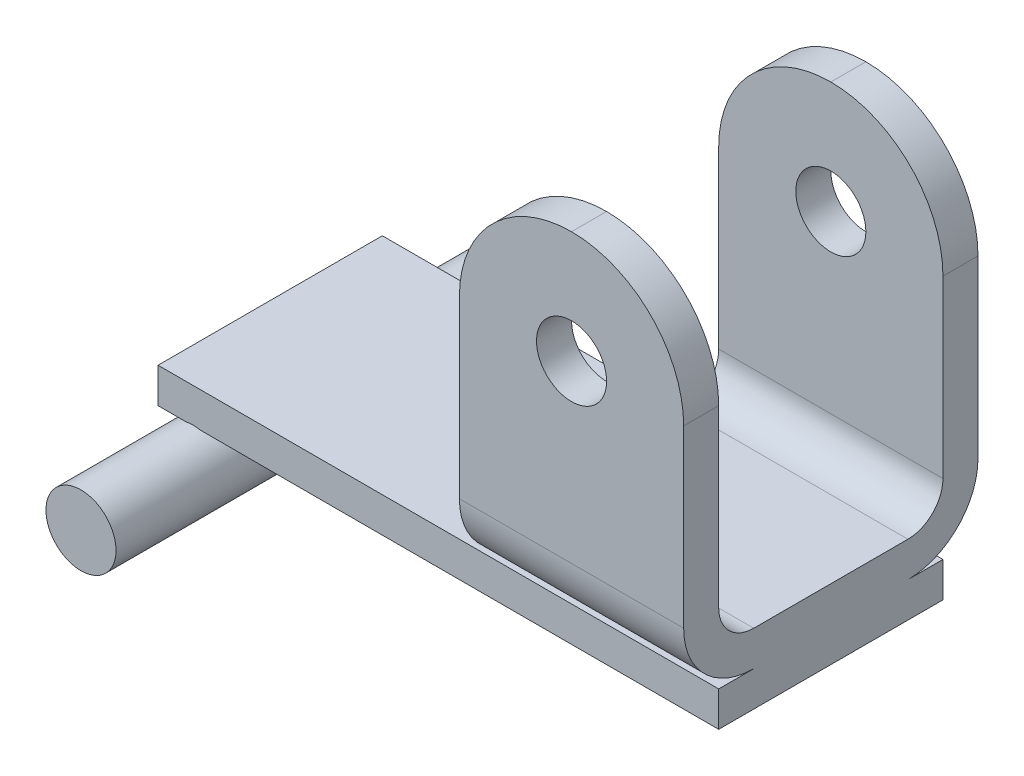
ISO-10303-21;
HEADER;
FILE_DESCRIPTION(('STEP AP214'),'2;1');
FILE_NAME('part.step','',(''),(''),'','','');
FILE_SCHEMA(('AUTOMOTIVE_DESIGN { 1 0 10303 214 1 1 1 1 }'));
ENDSEC;
DATA;
#1=APPLICATION_CONTEXT('core data for automotive mechanical design processes');
#2=APPLICATION_PROTOCOL_DEFINITION('international standard','automotive_design',2000,#1);
#3=PRODUCT_CONTEXT('',#1,'mechanical');
#4=PRODUCT('Part','Part','',(#3));
#5=PRODUCT_RELATED_PRODUCT_CATEGORY('part','',(#4));
#6=PRODUCT_DEFINITION_FORMATION('','',#4);
#7=PRODUCT_DEFINITION_CONTEXT('part definition',#1,'design');
#8=PRODUCT_DEFINITION('design','',#6,#7);
#9=PRODUCT_DEFINITION_SHAPE('','',#8);
#10=(LENGTH_UNIT() NAMED_UNIT(*) SI_UNIT(.MILLI.,.METRE.));
#11=(NAMED_UNIT(*) PLANE_ANGLE_UNIT() SI_UNIT($,.RADIAN.));
#12=(NAMED_UNIT(*) SI_UNIT($,.STERADIAN.) SOLID_ANGLE_UNIT());
#13=UNCERTAINTY_MEASURE_WITH_UNIT(LENGTH_MEASURE(1.E-05),#10,'distance_accuracy_value','');
#14=(GEOMETRIC_REPRESENTATION_CONTEXT(3) GLOBAL_UNCERTAINTY_ASSIGNED_CONTEXT((#13)) GLOBAL_UNIT_ASSIGNED_CONTEXT((#10,
#11,#12)) REPRESENTATION_CONTEXT('',''));
#15=CARTESIAN_POINT('',(0.,0.,0.));
#16=DIRECTION('',(0.,0.,1.));
#17=DIRECTION('',(1.,0.,0.));
#18=AXIS2_PLACEMENT_3D('',#15,#16,#17);
#19=CARTESIAN_POINT('',(-0.500000000000035,0.99,1.6));
#20=DIRECTION('',(0.,-1.,0.));
#21=DIRECTION('',(0.,0.,-1.));
#22=AXIS2_PLACEMENT_3D('',#19,#20,#21);
#23=PLANE('',#22);
#24=DIRECTION('',(1.,0.,0.));
#25=VECTOR('',#24,1.);
#26=CARTESIAN_POINT('',(4.29999999999997,0.990000000000008,1.09999999999999));
#27=LINE('',#26,#25);
#28=CARTESIAN_POINT('',(4.29999999999997,0.990000000000008,1.09999999999999));
#29=VERTEX_POINT('',#28);
#30=CARTESIAN_POINT('',(7.49999999999998,0.99000000000001,1.09999999999999));
#31=VERTEX_POINT('',#30);
#32=EDGE_CURVE('E173',#29,#31,#27,.T.);
#33=ORIENTED_EDGE('',*,*,#32,.F.);
#34=DIRECTION('',(0.,0.,1.));
#35=VECTOR('',#34,1.);
#36=CARTESIAN_POINT('',(4.29999999999997,0.990000000000008,1.09999999999999));
#37=LINE('',#36,#35);
#38=CARTESIAN_POINT('',(4.29999999999998,0.990000000000006,-1.09999999999999));
#39=VERTEX_POINT('',#38);
#40=EDGE_CURVE('E216',#39,#29,#37,.T.);
#41=ORIENTED_EDGE('',*,*,#40,.F.);
#42=DIRECTION('',(1.,0.,0.));
#43=VECTOR('',#42,1.);
#44=CARTESIAN_POINT('',(4.29999999999998,0.990000000000006,-1.09999999999999));
#45=LINE('',#44,#43);
#46=CARTESIAN_POINT('',(7.49999999999998,0.990000000000012,-1.09999999999999));
#47=VERTEX_POINT('',#46);
#48=EDGE_CURVE('E245',#39,#47,#45,.T.);
#49=ORIENTED_EDGE('',*,*,#48,.T.);
#50=DIRECTION('',(0.,0.,-1.));
#51=VECTOR('',#50,1.);
#52=CARTESIAN_POINT('',(7.49999999999997,0.990000000000013,1.6));
#53=LINE('',#52,#51);
#54=CARTESIAN_POINT('',(7.49999999999998,0.990000000000012,-1.6));
#55=VERTEX_POINT('',#54);
#56=EDGE_CURVE('E252',#47,#55,#53,.T.);
#57=ORIENTED_EDGE('',*,*,#56,.T.);
#58=DIRECTION('',(-1.,0.,0.));
#59=VECTOR('',#58,1.);
#60=CARTESIAN_POINT('',(-0.500000000000063,0.990000000000002,-1.6));
#61=LINE('',#60,#59);
#62=CARTESIAN_POINT('',(-0.500000000000063,0.990000000000002,-1.6));
#63=VERTEX_POINT('',#62);
#64=EDGE_CURVE('E400',#55,#63,#61,.T.);
#65=ORIENTED_EDGE('',*,*,#64,.T.);
#66=DIRECTION('',(0.,0.,-1.));
#67=VECTOR('',#66,1.);
#68=CARTESIAN_POINT('',(-0.500000000000035,0.99,1.6));
#69=LINE('',#68,#67);
#70=CARTESIAN_POINT('',(-0.500000000000035,0.99,1.6));
#71=VERTEX_POINT('',#70);
#72=EDGE_CURVE('E344',#71,#63,#69,.T.);
#73=ORIENTED_EDGE('',*,*,#72,.F.);
#74=DIRECTION('',(-1.,0.,0.));
#75=VECTOR('',#74,1.);
#76=CARTESIAN_POINT('',(-0.500000000000035,0.99,1.6));
#77=LINE('',#76,#75);
#78=CARTESIAN_POINT('',(7.49999999999997,0.990000000000013,1.6));
#79=VERTEX_POINT('',#78);
#80=EDGE_CURVE('E338',#79,#71,#77,.T.);
#81=ORIENTED_EDGE('',*,*,#80,.F.);
#82=EDGE_CURVE('E336',#79,#31,#53,.T.);
#83=ORIENTED_EDGE('',*,*,#82,.T.);
#84=EDGE_LOOP('',(#33,#41,#49,#57,#65,#73,#81,#83));
#85=FACE_BOUND('',#84,.T.);
#86=ADVANCED_FACE('F32',(#85),#23,.F.);
#87=CARTESIAN_POINT('',(0.,0.,3.2));
#88=DIRECTION('',(0.,0.,-1.));
#89=DIRECTION('',(-1.,0.,0.));
#90=AXIS2_PLACEMENT_3D('',#87,#88,#89);
#91=CYLINDRICAL_SURFACE('',#90,0.5);
#92=DIRECTION('',(0.,0.,-1.));
#93=VECTOR('',#92,1.);
#94=CARTESIAN_POINT('',(0.0994987437106659,0.49,3.19999999999998));
#95=LINE('',#94,#93);
#96=CARTESIAN_POINT('',(0.0994987437106659,0.490000000000004,1.59999999999998));
#97=VERTEX_POINT('',#96);
#98=CARTESIAN_POINT('',(0.0994987437106659,0.49,-1.60000000000002));
#99=VERTEX_POINT('',#98);
#100=EDGE_CURVE('E365',#97,#99,#95,.T.);
#101=ORIENTED_EDGE('',*,*,#100,.F.);
#102=CARTESIAN_POINT('',(0.,0.,1.6));
#103=DIRECTION('',(0.,0.,1.));
#104=DIRECTION('',(1.,0.,0.));
#105=AXIS2_PLACEMENT_3D('',#102,#103,#104);
#106=CIRCLE('',#105,0.5);
#107=CARTESIAN_POINT('',(-0.0994987437106659,0.49,1.6));
#108=VERTEX_POINT('',#107);
#109=EDGE_CURVE('E266',#97,#108,#106,.T.);
#110=ORIENTED_EDGE('',*,*,#109,.T.);
#111=DIRECTION('',(0.,0.,-1.));
#112=VECTOR('',#111,1.);
#113=CARTESIAN_POINT('',(-0.0994987437106937,0.490000000000003,3.2));
#114=LINE('',#113,#112);
#115=CARTESIAN_POINT('',(-0.0994987437107006,0.490000000000001,-1.6));
#116=VERTEX_POINT('',#115);
#117=EDGE_CURVE('E363',#116,#108,#114,.F.);
#118=ORIENTED_EDGE('',*,*,#117,.F.);
#119=CARTESIAN_POINT('',(0.,0.,-1.6));
#120=DIRECTION('',(0.,0.,1.));
#121=DIRECTION('',(1.,0.,0.));
#122=AXIS2_PLACEMENT_3D('',#119,#120,#121);
#123=CIRCLE('',#122,0.5);
#124=EDGE_CURVE('E360',#99,#116,#123,.T.);
#125=ORIENTED_EDGE('',*,*,#124,.F.);
#126=EDGE_LOOP('',(#101,#110,#118,#125));
#127=FACE_BOUND('',#126,.T.);
#128=CARTESIAN_POINT('',(0.,0.,3.2));
#129=DIRECTION('',(0.,0.,1.));
#130=DIRECTION('',(1.,0.,0.));
#131=AXIS2_PLACEMENT_3D('',#128,#129,#130);
#132=CIRCLE('',#131,0.5);
#133=CARTESIAN_POINT('',(0.5,0.,3.2));
#134=VERTEX_POINT('',#133);
#135=EDGE_CURVE('E357',#134,#134,#132,.T.);
#136=ORIENTED_EDGE('',*,*,#135,.F.);
#137=EDGE_LOOP('',(#136));
#138=FACE_BOUND('',#137,.T.);
#139=CARTESIAN_POINT('',(0.,0.,-3.2));
#140=DIRECTION('',(0.,0.,1.));
#141=DIRECTION('',(1.,0.,0.));
#142=AXIS2_PLACEMENT_3D('',#139,#140,#141);
#143=CIRCLE('',#142,0.5);
#144=CARTESIAN_POINT('',(0.499999999999966,0.,-3.2));
#145=VERTEX_POINT('',#144);
#146=EDGE_CURVE('E354',#145,#145,#143,.T.);
#147=ORIENTED_EDGE('',*,*,#146,.T.);
#148=EDGE_LOOP('',(#147));
#149=FACE_BOUND('',#148,.T.);
#150=ADVANCED_FACE('F34',(#127,#138,#149),#91,.T.);
#151=CARTESIAN_POINT('',(0.,0.,3.2));
#152=DIRECTION('',(0.,0.,1.));
#153=DIRECTION('',(1.,0.,0.));
#154=AXIS2_PLACEMENT_3D('',#151,#152,#153);
#155=PLANE('',#154);
#156=ORIENTED_EDGE('',*,*,#135,.T.);
#157=EDGE_LOOP('',(#156));
#158=FACE_BOUND('',#157,.T.);
#159=ADVANCED_FACE('F415',(#158),#155,.T.);
#160=CARTESIAN_POINT('',(0.,0.,-3.2));
#161=DIRECTION('',(0.,0.,1.));
#162=DIRECTION('',(1.,0.,0.));
#163=AXIS2_PLACEMENT_3D('',#160,#161,#162);
#164=PLANE('',#163);
#165=ORIENTED_EDGE('',*,*,#146,.F.);
#166=EDGE_LOOP('',(#165));
#167=FACE_BOUND('',#166,.T.);
#168=ADVANCED_FACE('F409',(#167),#164,.F.);
#169=CARTESIAN_POINT('',(-0.5,0.489999999999996,1.6));
#170=DIRECTION('',(0.,1.,0.));
#171=DIRECTION('',(0.,0.,1.));
#172=AXIS2_PLACEMENT_3D('',#169,#170,#171);
#173=PLANE('',#172);
#174=DIRECTION('',(1.,0.,0.));
#175=VECTOR('',#174,1.);
#176=CARTESIAN_POINT('',(-0.5,0.489999999999996,1.6));
#177=LINE('',#176,#175);
#178=CARTESIAN_POINT('',(7.49999999999998,0.490000000000009,1.6));
#179=VERTEX_POINT('',#178);
#180=EDGE_CURVE('E386',#97,#179,#177,.T.);
#181=ORIENTED_EDGE('',*,*,#180,.F.);
#182=ORIENTED_EDGE('',*,*,#100,.T.);
#183=DIRECTION('',(1.,0.,0.));
#184=VECTOR('',#183,1.);
#185=CARTESIAN_POINT('',(-0.500000000000035,0.489999999999999,-1.6));
#186=LINE('',#185,#184);
#187=CARTESIAN_POINT('',(7.49999999999999,0.490000000000011,-1.6));
#188=VERTEX_POINT('',#187);
#189=EDGE_CURVE('E401',#99,#188,#186,.T.);
#190=ORIENTED_EDGE('',*,*,#189,.T.);
#191=DIRECTION('',(0.,0.,-1.));
#192=VECTOR('',#191,1.);
#193=CARTESIAN_POINT('',(7.49999999999998,0.490000000000009,1.6));
#194=LINE('',#193,#192);
#195=EDGE_CURVE('E340',#179,#188,#194,.T.);
#196=ORIENTED_EDGE('',*,*,#195,.F.);
#197=EDGE_LOOP('',(#181,#182,#190,#196));
#198=FACE_BOUND('',#197,.T.);
#199=ADVANCED_FACE('F407',(#198),#173,.F.);
#200=CARTESIAN_POINT('',(-0.500000000000035,0.489999999999999,-1.6));
#201=VERTEX_POINT('',#200);
#202=EDGE_CURVE('E380',#201,#116,#186,.T.);
#203=ORIENTED_EDGE('',*,*,#202,.T.);
#204=ORIENTED_EDGE('',*,*,#117,.T.);
#205=CARTESIAN_POINT('',(-0.5,0.489999999999996,1.6));
#206=VERTEX_POINT('',#205);
#207=EDGE_CURVE('E378',#206,#108,#177,.T.);
#208=ORIENTED_EDGE('',*,*,#207,.F.);
#209=DIRECTION('',(0.,0.,-1.));
#210=VECTOR('',#209,1.);
#211=CARTESIAN_POINT('',(-0.5,0.489999999999996,1.6));
#212=LINE('',#211,#210);
#213=EDGE_CURVE('E342',#206,#201,#212,.T.);
#214=ORIENTED_EDGE('',*,*,#213,.T.);
#215=EDGE_LOOP('',(#203,#204,#208,#214));
#216=FACE_BOUND('',#215,.T.);
#217=ADVANCED_FACE('F377',(#216),#173,.F.);
#218=CARTESIAN_POINT('',(-0.5,0.489999999999996,1.6));
#219=DIRECTION('',(0.,0.,1.));
#220=DIRECTION('',(1.,0.,0.));
#221=AXIS2_PLACEMENT_3D('',#218,#219,#220);
#222=PLANE('',#221);
#223=ORIENTED_EDGE('',*,*,#109,.F.);
#224=ORIENTED_EDGE('',*,*,#180,.T.);
#225=DIRECTION('',(0.,1.,0.));
#226=VECTOR('',#225,1.);
#227=CARTESIAN_POINT('',(7.49999999999997,0.990000000000013,1.6));
#228=LINE('',#227,#226);
#229=EDGE_CURVE('E385',#179,#79,#228,.T.);
#230=ORIENTED_EDGE('',*,*,#229,.T.);
#231=ORIENTED_EDGE('',*,*,#80,.T.);
#232=DIRECTION('',(0.,-1.,0.));
#233=VECTOR('',#232,1.);
#234=CARTESIAN_POINT('',(-0.500000000000035,0.99,1.6));
#235=LINE('',#234,#233);
#236=EDGE_CURVE('E383',#71,#206,#235,.T.);
#237=ORIENTED_EDGE('',*,*,#236,.T.);
#238=ORIENTED_EDGE('',*,*,#207,.T.);
#239=EDGE_LOOP('',(#223,#224,#230,#231,#237,#238));
#240=FACE_BOUND('',#239,.T.);
#241=ADVANCED_FACE('F381',(#240),#222,.T.);
#242=CARTESIAN_POINT('',(-0.500000000000035,0.489999999999999,-1.6));
#243=DIRECTION('',(0.,0.,1.));
#244=DIRECTION('',(1.,0.,0.));
#245=AXIS2_PLACEMENT_3D('',#242,#243,#244);
#246=PLANE('',#245);
#247=ORIENTED_EDGE('',*,*,#189,.F.);
#248=ORIENTED_EDGE('',*,*,#124,.T.);
#249=ORIENTED_EDGE('',*,*,#202,.F.);
#250=DIRECTION('',(0.,-1.,0.));
#251=VECTOR('',#250,1.);
#252=CARTESIAN_POINT('',(-0.500000000000063,0.990000000000002,-1.6));
#253=LINE('',#252,#251);
#254=EDGE_CURVE('E234',#63,#201,#253,.T.);
#255=ORIENTED_EDGE('',*,*,#254,.F.);
#256=ORIENTED_EDGE('',*,*,#64,.F.);
#257=DIRECTION('',(0.,1.,0.));
#258=VECTOR('',#257,1.);
#259=CARTESIAN_POINT('',(7.49999999999998,0.990000000000012,-1.6));
#260=LINE('',#259,#258);
#261=EDGE_CURVE('E404',#188,#55,#260,.T.);
#262=ORIENTED_EDGE('',*,*,#261,.F.);
#263=EDGE_LOOP('',(#247,#248,#249,#255,#256,#262));
#264=FACE_BOUND('',#263,.T.);
#265=ADVANCED_FACE('F398',(#264),#246,.F.);
#266=CARTESIAN_POINT('',(-0.500000000000035,0.99,1.6));
#267=DIRECTION('',(1.,0.,0.));
#268=DIRECTION('',(0.,1.,0.));
#269=AXIS2_PLACEMENT_3D('',#266,#267,#268);
#270=PLANE('',#269);
#271=ORIENTED_EDGE('',*,*,#254,.T.);
#272=ORIENTED_EDGE('',*,*,#213,.F.);
#273=ORIENTED_EDGE('',*,*,#236,.F.);
#274=ORIENTED_EDGE('',*,*,#72,.T.);
#275=EDGE_LOOP('',(#271,#272,#273,#274));
#276=FACE_BOUND('',#275,.T.);
#277=ADVANCED_FACE('F395',(#276),#270,.F.);
#278=CARTESIAN_POINT('',(7.49999999999997,0.990000000000013,1.6));
#279=DIRECTION('',(-1.,0.,0.));
#280=DIRECTION('',(0.,0.,1.));
#281=AXIS2_PLACEMENT_3D('',#278,#279,#280);
#282=PLANE('',#281);
#283=DIRECTION('',(0.,-1.,0.));
#284=VECTOR('',#283,1.);
#285=CARTESIAN_POINT('',(7.5,6.09000000000002,-2.10000000000002));
#286=LINE('',#285,#284);
#287=CARTESIAN_POINT('',(7.49999999999999,4.49000000000002,-2.10000000000002));
#288=VERTEX_POINT('',#287);
#289=CARTESIAN_POINT('',(7.49999999999998,1.99000000000002,-2.1));
#290=VERTEX_POINT('',#289);
#291=EDGE_CURVE('E197',#288,#290,#286,.T.);
#292=ORIENTED_EDGE('',*,*,#291,.F.);
#293=DIRECTION('',(0.,0.,-1.));
#294=VECTOR('',#293,1.);
#295=CARTESIAN_POINT('',(7.49999999999997,4.49000000000002,1.59999999999998));
#296=LINE('',#295,#294);
#297=CARTESIAN_POINT('',(7.49999999999999,4.49000000000002,-1.60000000000002));
#298=VERTEX_POINT('',#297);
#299=EDGE_CURVE('E269',#288,#298,#296,.F.);
#300=ORIENTED_EDGE('',*,*,#299,.T.);
#301=DIRECTION('',(0.,1.,0.));
#302=VECTOR('',#301,1.);
#303=CARTESIAN_POINT('',(7.5,6.09000000000002,-1.60000000000001));
#304=LINE('',#303,#302);
#305=CARTESIAN_POINT('',(7.49999999999998,1.99000000000002,-1.6));
#306=VERTEX_POINT('',#305);
#307=EDGE_CURVE('E199',#298,#306,#304,.F.);
#308=ORIENTED_EDGE('',*,*,#307,.T.);
#309=CARTESIAN_POINT('',(7.49999999999997,1.99000000000001,-1.1));
#310=DIRECTION('',(1.,0.,0.));
#311=DIRECTION('',(0.,0.,-1.));
#312=AXIS2_PLACEMENT_3D('',#309,#310,#311);
#313=CIRCLE('',#312,0.5);
#314=CARTESIAN_POINT('',(7.49999999999999,1.49000000000001,-1.09999999999999));
#315=VERTEX_POINT('',#314);
#316=EDGE_CURVE('E201',#306,#315,#313,.F.);
#317=ORIENTED_EDGE('',*,*,#316,.T.);
#318=DIRECTION('',(0.,0.,-1.));
#319=VECTOR('',#318,1.);
#320=CARTESIAN_POINT('',(7.49999999999998,1.49000000000001,1.09999999999999));
#321=LINE('',#320,#319);
#322=CARTESIAN_POINT('',(7.49999999999998,1.49000000000001,1.1));
#323=VERTEX_POINT('',#322);
#324=EDGE_CURVE('E204',#315,#323,#321,.F.);
#325=ORIENTED_EDGE('',*,*,#324,.T.);
#326=CARTESIAN_POINT('',(7.49999999999997,1.99000000000001,1.1));
#327=DIRECTION('',(1.,0.,0.));
#328=DIRECTION('',(0.,0.,-1.));
#329=AXIS2_PLACEMENT_3D('',#326,#327,#328);
#330=CIRCLE('',#329,0.5);
#331=CARTESIAN_POINT('',(7.49999999999998,1.99000000000002,1.6));
#332=VERTEX_POINT('',#331);
#333=EDGE_CURVE('E207',#323,#332,#330,.F.);
#334=ORIENTED_EDGE('',*,*,#333,.T.);
#335=DIRECTION('',(0.,1.,0.));
#336=VECTOR('',#335,1.);
#337=CARTESIAN_POINT('',(7.49999999999999,6.09000000000002,1.59999999999999));
#338=LINE('',#337,#336);
#339=CARTESIAN_POINT('',(7.49999999999997,4.49000000000002,1.59999999999998));
#340=VERTEX_POINT('',#339);
#341=EDGE_CURVE('E191',#332,#340,#338,.T.);
#342=ORIENTED_EDGE('',*,*,#341,.T.);
#343=DIRECTION('',(0.,0.,-1.));
#344=VECTOR('',#343,1.);
#345=CARTESIAN_POINT('',(7.49999999999997,4.49000000000002,1.59999999999998));
#346=LINE('',#345,#344);
#347=CARTESIAN_POINT('',(7.5,4.49000000000002,2.09999999999998));
#348=VERTEX_POINT('',#347);
#349=EDGE_CURVE('E190',#340,#348,#346,.F.);
#350=ORIENTED_EDGE('',*,*,#349,.T.);
#351=DIRECTION('',(0.,1.,0.));
#352=VECTOR('',#351,1.);
#353=CARTESIAN_POINT('',(7.5,6.09000000000002,2.09999999999998));
#354=LINE('',#353,#352);
#355=CARTESIAN_POINT('',(7.5,1.99000000000002,2.1));
#356=VERTEX_POINT('',#355);
#357=EDGE_CURVE('E179',#356,#348,#354,.T.);
#358=ORIENTED_EDGE('',*,*,#357,.F.);
#359=CARTESIAN_POINT('',(7.49999999999997,1.99000000000001,1.1));
#360=DIRECTION('',(-1.,0.,0.));
#361=DIRECTION('',(0.,0.,1.));
#362=AXIS2_PLACEMENT_3D('',#359,#360,#361);
#363=CIRCLE('',#362,1.);
#364=EDGE_CURVE('E167',#31,#356,#363,.T.);
#365=ORIENTED_EDGE('',*,*,#364,.F.);
#366=ORIENTED_EDGE('',*,*,#82,.F.);
#367=ORIENTED_EDGE('',*,*,#229,.F.);
#368=ORIENTED_EDGE('',*,*,#195,.T.);
#369=ORIENTED_EDGE('',*,*,#261,.T.);
#370=ORIENTED_EDGE('',*,*,#56,.F.);
#371=CARTESIAN_POINT('',(7.49999999999997,1.99000000000001,-1.1));
#372=DIRECTION('',(-1.,0.,0.));
#373=DIRECTION('',(0.,0.,1.));
#374=AXIS2_PLACEMENT_3D('',#371,#372,#373);
#375=CIRCLE('',#374,1.);
#376=EDGE_CURVE('E178',#290,#47,#375,.T.);
#377=ORIENTED_EDGE('',*,*,#376,.F.);
#378=EDGE_LOOP('',(#292,#300,#308,#317,#325,#334,#342,#350,#358,#365,#366,#367,#368,#369,#370,#377));
#379=FACE_BOUND('',#378,.T.);
#380=ADVANCED_FACE('F187',(#379),#282,.F.);
#381=CARTESIAN_POINT('',(4.29999999999998,6.09000000000001,1.6));
#382=DIRECTION('',(0.,0.,-1.));
#383=DIRECTION('',(0.,1.,0.));
#384=AXIS2_PLACEMENT_3D('',#381,#382,#383);
#385=PLANE('',#384);
#386=CARTESIAN_POINT('',(5.89999999999998,4.49000000000002,1.6));
#387=DIRECTION('',(0.,0.,-1.));
#388=DIRECTION('',(0.,1.,0.));
#389=AXIS2_PLACEMENT_3D('',#386,#387,#388);
#390=CIRCLE('',#389,0.500000000000001);
#391=CARTESIAN_POINT('',(5.89999999999998,4.99000000000002,1.6));
#392=VERTEX_POINT('',#391);
#393=EDGE_CURVE('E193',#392,#392,#390,.T.);
#394=ORIENTED_EDGE('',*,*,#393,.F.);
#395=EDGE_LOOP('',(#394));
#396=FACE_BOUND('',#395,.T.);
#397=CARTESIAN_POINT('',(5.89999999999997,4.49000000000002,1.6));
#398=DIRECTION('',(0.,0.,-1.));
#399=DIRECTION('',(0.,1.,0.));
#400=AXIS2_PLACEMENT_3D('',#397,#398,#399);
#401=CIRCLE('',#400,1.6);
#402=CARTESIAN_POINT('',(4.29999999999998,4.49000000000001,1.6));
#403=VERTEX_POINT('',#402);
#404=CARTESIAN_POINT('',(5.89999999999998,6.09000000000002,1.59999999999998));
#405=VERTEX_POINT('',#404);
#406=EDGE_CURVE('E276',#403,#405,#401,.T.);
#407=ORIENTED_EDGE('',*,*,#406,.T.);
#408=CARTESIAN_POINT('',(5.89999999999997,4.49000000000002,1.6));
#409=DIRECTION('',(0.,0.,-1.));
#410=DIRECTION('',(0.,1.,0.));
#411=AXIS2_PLACEMENT_3D('',#408,#409,#410);
#412=CIRCLE('',#411,1.6);
#413=EDGE_CURVE('E278',#405,#340,#412,.T.);
#414=ORIENTED_EDGE('',*,*,#413,.T.);
#415=ORIENTED_EDGE('',*,*,#341,.F.);
#416=DIRECTION('',(1.,0.,0.));
#417=VECTOR('',#416,1.);
#418=CARTESIAN_POINT('',(4.29999999999997,1.99000000000002,1.59999999999998));
#419=LINE('',#418,#417);
#420=CARTESIAN_POINT('',(4.29999999999997,1.99000000000002,1.59999999999998));
#421=VERTEX_POINT('',#420);
#422=EDGE_CURVE('E232',#421,#332,#419,.T.);
#423=ORIENTED_EDGE('',*,*,#422,.F.);
#424=DIRECTION('',(0.,1.,0.));
#425=VECTOR('',#424,1.);
#426=CARTESIAN_POINT('',(4.29999999999998,6.09000000000001,1.6));
#427=LINE('',#426,#425);
#428=EDGE_CURVE('E210',#421,#403,#427,.T.);
#429=ORIENTED_EDGE('',*,*,#428,.T.);
#430=EDGE_LOOP('',(#407,#414,#415,#423,#429));
#431=FACE_BOUND('',#430,.T.);
#432=ADVANCED_FACE('F290',(#396,#431),#385,.T.);
#433=CARTESIAN_POINT('',(4.29999999999998,1.99000000000001,1.09999999999998));
#434=DIRECTION('',(1.,0.,0.));
#435=DIRECTION('',(0.,0.,-1.));
#436=AXIS2_PLACEMENT_3D('',#433,#434,#435);
#437=CYLINDRICAL_SURFACE('',#436,0.5);
#438=ORIENTED_EDGE('',*,*,#333,.F.);
#439=DIRECTION('',(1.,0.,0.));
#440=VECTOR('',#439,1.);
#441=CARTESIAN_POINT('',(4.29999999999997,1.49000000000001,1.1));
#442=LINE('',#441,#440);
#443=CARTESIAN_POINT('',(4.29999999999997,1.49000000000001,1.1));
#444=VERTEX_POINT('',#443);
#445=EDGE_CURVE('E235',#444,#323,#442,.T.);
#446=ORIENTED_EDGE('',*,*,#445,.F.);
#447=CARTESIAN_POINT('',(4.29999999999998,1.99000000000001,1.09999999999998));
#448=DIRECTION('',(1.,0.,0.));
#449=DIRECTION('',(0.,0.,-1.));
#450=AXIS2_PLACEMENT_3D('',#447,#448,#449);
#451=CIRCLE('',#450,0.5);
#452=EDGE_CURVE('E183',#444,#421,#451,.F.);
#453=ORIENTED_EDGE('',*,*,#452,.T.);
#454=ORIENTED_EDGE('',*,*,#422,.T.);
#455=EDGE_LOOP('',(#438,#446,#453,#454));
#456=FACE_BOUND('',#455,.T.);
#457=ADVANCED_FACE('F304',(#456),#437,.F.);
#458=CARTESIAN_POINT('',(4.29999999999997,1.49000000000001,1.09999999999999));
#459=DIRECTION('',(0.,1.,0.));
#460=DIRECTION('',(0.,0.,1.));
#461=AXIS2_PLACEMENT_3D('',#458,#459,#460);
#462=PLANE('',#461);
#463=ORIENTED_EDGE('',*,*,#324,.F.);
#464=DIRECTION('',(1.,0.,0.));
#465=VECTOR('',#464,1.);
#466=CARTESIAN_POINT('',(4.29999999999998,1.49000000000001,-1.09999999999999));
#467=LINE('',#466,#465);
#468=CARTESIAN_POINT('',(4.29999999999998,1.49000000000001,-1.09999999999999));
#469=VERTEX_POINT('',#468);
#470=EDGE_CURVE('E237',#469,#315,#467,.T.);
#471=ORIENTED_EDGE('',*,*,#470,.F.);
#472=DIRECTION('',(0.,0.,-1.));
#473=VECTOR('',#472,1.);
#474=CARTESIAN_POINT('',(4.29999999999997,1.49000000000001,1.09999999999999));
#475=LINE('',#474,#473);
#476=EDGE_CURVE('E227',#469,#444,#475,.F.);
#477=ORIENTED_EDGE('',*,*,#476,.T.);
#478=ORIENTED_EDGE('',*,*,#445,.T.);
#479=EDGE_LOOP('',(#463,#471,#477,#478));
#480=FACE_BOUND('',#479,.T.);
#481=ADVANCED_FACE('F498',(#480),#462,.T.);
#482=CARTESIAN_POINT('',(4.29999999999998,1.99000000000001,-1.10000000000002));
#483=DIRECTION('',(1.,0.,0.));
#484=DIRECTION('',(0.,0.,-1.));
#485=AXIS2_PLACEMENT_3D('',#482,#483,#484);
#486=CYLINDRICAL_SURFACE('',#485,0.5);
#487=ORIENTED_EDGE('',*,*,#316,.F.);
#488=DIRECTION('',(1.,0.,0.));
#489=VECTOR('',#488,1.);
#490=CARTESIAN_POINT('',(4.29999999999998,1.99000000000001,-1.60000000000002));
#491=LINE('',#490,#489);
#492=CARTESIAN_POINT('',(4.29999999999998,1.99000000000001,-1.60000000000002));
#493=VERTEX_POINT('',#492);
#494=EDGE_CURVE('E239',#493,#306,#491,.T.);
#495=ORIENTED_EDGE('',*,*,#494,.F.);
#496=CARTESIAN_POINT('',(4.29999999999998,1.99000000000001,-1.10000000000002));
#497=DIRECTION('',(1.,0.,0.));
#498=DIRECTION('',(0.,0.,-1.));
#499=AXIS2_PLACEMENT_3D('',#496,#497,#498);
#500=CIRCLE('',#499,0.5);
#501=EDGE_CURVE('E224',#493,#469,#500,.F.);
#502=ORIENTED_EDGE('',*,*,#501,.T.);
#503=ORIENTED_EDGE('',*,*,#470,.T.);
#504=EDGE_LOOP('',(#487,#495,#502,#503));
#505=FACE_BOUND('',#504,.T.);
#506=ADVANCED_FACE('F311',(#505),#486,.F.);
#507=CARTESIAN_POINT('',(4.29999999999999,6.09000000000001,-1.6));
#508=DIRECTION('',(0.,0.,1.));
#509=DIRECTION('',(1.,0.,0.));
#510=AXIS2_PLACEMENT_3D('',#507,#508,#509);
#511=PLANE('',#510);
#512=CARTESIAN_POINT('',(5.89999999999999,4.49000000000001,-1.6));
#513=DIRECTION('',(0.,0.,1.));
#514=DIRECTION('',(1.,0.,0.));
#515=AXIS2_PLACEMENT_3D('',#512,#513,#514);
#516=CIRCLE('',#515,0.500000000000001);
#517=CARTESIAN_POINT('',(6.39999999999999,4.49000000000002,-1.6));
#518=VERTEX_POINT('',#517);
#519=EDGE_CURVE('E631',#518,#518,#516,.T.);
#520=ORIENTED_EDGE('',*,*,#519,.F.);
#521=EDGE_LOOP('',(#520));
#522=FACE_BOUND('',#521,.T.);
#523=ORIENTED_EDGE('',*,*,#307,.F.);
#524=CARTESIAN_POINT('',(5.89999999999999,4.49000000000001,-1.6));
#525=DIRECTION('',(0.,0.,1.));
#526=DIRECTION('',(1.,0.,0.));
#527=AXIS2_PLACEMENT_3D('',#524,#525,#526);
#528=CIRCLE('',#527,1.6);
#529=CARTESIAN_POINT('',(5.89999999999999,6.09000000000001,-1.60000000000002));
#530=VERTEX_POINT('',#529);
#531=EDGE_CURVE('E274',#298,#530,#528,.T.);
#532=ORIENTED_EDGE('',*,*,#531,.T.);
#533=CARTESIAN_POINT('',(5.89999999999999,4.49000000000001,-1.6));
#534=DIRECTION('',(0.,0.,1.));
#535=DIRECTION('',(1.,0.,0.));
#536=AXIS2_PLACEMENT_3D('',#533,#534,#535);
#537=CIRCLE('',#536,1.6);
#538=CARTESIAN_POINT('',(4.29999999999999,4.49000000000001,-1.6));
#539=VERTEX_POINT('',#538);
#540=EDGE_CURVE('E272',#530,#539,#537,.T.);
#541=ORIENTED_EDGE('',*,*,#540,.T.);
#542=DIRECTION('',(0.,1.,0.));
#543=VECTOR('',#542,1.);
#544=CARTESIAN_POINT('',(4.29999999999999,6.09000000000001,-1.6));
#545=LINE('',#544,#543);
#546=EDGE_CURVE('E222',#539,#493,#545,.F.);
#547=ORIENTED_EDGE('',*,*,#546,.T.);
#548=ORIENTED_EDGE('',*,*,#494,.T.);
#549=EDGE_LOOP('',(#523,#532,#541,#547,#548));
#550=FACE_BOUND('',#549,.T.);
#551=ADVANCED_FACE('F314',(#522,#550),#511,.T.);
#552=CARTESIAN_POINT('',(4.3,6.09000000000002,-2.1));
#553=DIRECTION('',(0.,0.,1.));
#554=DIRECTION('',(1.,0.,0.));
#555=AXIS2_PLACEMENT_3D('',#552,#553,#554);
#556=PLANE('',#555);
#557=CARTESIAN_POINT('',(5.89999999999999,4.49000000000002,-2.1));
#558=DIRECTION('',(0.,0.,1.));
#559=DIRECTION('',(1.,0.,0.));
#560=AXIS2_PLACEMENT_3D('',#557,#558,#559);
#561=CIRCLE('',#560,0.500000000000001);
#562=CARTESIAN_POINT('',(6.39999999999999,4.49000000000002,-2.1));
#563=VERTEX_POINT('',#562);
#564=EDGE_CURVE('E626',#563,#563,#561,.T.);
#565=ORIENTED_EDGE('',*,*,#564,.T.);
#566=EDGE_LOOP('',(#565));
#567=FACE_BOUND('',#566,.T.);
#568=CARTESIAN_POINT('',(5.89999999999999,4.49000000000002,-2.1));
#569=DIRECTION('',(0.,0.,1.));
#570=DIRECTION('',(1.,0.,0.));
#571=AXIS2_PLACEMENT_3D('',#568,#569,#570);
#572=CIRCLE('',#571,1.6);
#573=CARTESIAN_POINT('',(4.29999999999999,4.49000000000002,-2.1));
#574=VERTEX_POINT('',#573);
#575=CARTESIAN_POINT('',(5.89999999999999,6.09000000000002,-2.10000000000002));
#576=VERTEX_POINT('',#575);
#577=EDGE_CURVE('E263',#574,#576,#572,.F.);
#578=ORIENTED_EDGE('',*,*,#577,.T.);
#579=CARTESIAN_POINT('',(5.89999999999999,4.49000000000002,-2.1));
#580=DIRECTION('',(0.,0.,1.));
#581=DIRECTION('',(1.,0.,0.));
#582=AXIS2_PLACEMENT_3D('',#579,#580,#581);
#583=CIRCLE('',#582,1.6);
#584=EDGE_CURVE('E265',#576,#288,#583,.F.);
#585=ORIENTED_EDGE('',*,*,#584,.T.);
#586=ORIENTED_EDGE('',*,*,#291,.T.);
#587=DIRECTION('',(1.,0.,0.));
#588=VECTOR('',#587,1.);
#589=CARTESIAN_POINT('',(4.29999999999999,1.99000000000002,-2.10000000000002));
#590=LINE('',#589,#588);
#591=CARTESIAN_POINT('',(4.29999999999999,1.99000000000002,-2.10000000000002));
#592=VERTEX_POINT('',#591);
#593=EDGE_CURVE('E242',#592,#290,#590,.T.);
#594=ORIENTED_EDGE('',*,*,#593,.F.);
#595=DIRECTION('',(0.,-1.,0.));
#596=VECTOR('',#595,1.);
#597=CARTESIAN_POINT('',(4.3,6.09000000000002,-2.1));
#598=LINE('',#597,#596);
#599=EDGE_CURVE('E220',#574,#592,#598,.T.);
#600=ORIENTED_EDGE('',*,*,#599,.F.);
#601=EDGE_LOOP('',(#578,#585,#586,#594,#600));
#602=FACE_BOUND('',#601,.T.);
#603=ADVANCED_FACE('F325',(#567,#602),#556,.F.);
#604=CARTESIAN_POINT('',(4.29999999999998,1.99000000000001,-1.10000000000002));
#605=DIRECTION('',(1.,0.,0.));
#606=DIRECTION('',(0.,0.,-1.));
#607=AXIS2_PLACEMENT_3D('',#604,#605,#606);
#608=CYLINDRICAL_SURFACE('',#607,1.);
#609=ORIENTED_EDGE('',*,*,#376,.T.);
#610=ORIENTED_EDGE('',*,*,#48,.F.);
#611=CARTESIAN_POINT('',(4.29999999999998,1.99000000000001,-1.10000000000002));
#612=DIRECTION('',(-1.,0.,0.));
#613=DIRECTION('',(0.,0.,1.));
#614=AXIS2_PLACEMENT_3D('',#611,#612,#613);
#615=CIRCLE('',#614,1.);
#616=EDGE_CURVE('E218',#592,#39,#615,.T.);
#617=ORIENTED_EDGE('',*,*,#616,.F.);
#618=ORIENTED_EDGE('',*,*,#593,.T.);
#619=EDGE_LOOP('',(#609,#610,#617,#618));
#620=FACE_BOUND('',#619,.T.);
#621=ADVANCED_FACE('F331',(#620),#608,.T.);
#622=CARTESIAN_POINT('',(4.29999999999998,1.99000000000001,1.09999999999998));
#623=DIRECTION('',(1.,0.,0.));
#624=DIRECTION('',(0.,0.,-1.));
#625=AXIS2_PLACEMENT_3D('',#622,#623,#624);
#626=CYLINDRICAL_SURFACE('',#625,1.);
#627=ORIENTED_EDGE('',*,*,#364,.T.);
#628=DIRECTION('',(1.,0.,0.));
#629=VECTOR('',#628,1.);
#630=CARTESIAN_POINT('',(4.29999999999999,1.99000000000002,2.09999999999998));
#631=LINE('',#630,#629);
#632=CARTESIAN_POINT('',(4.29999999999999,1.99000000000002,2.09999999999998));
#633=VERTEX_POINT('',#632);
#634=EDGE_CURVE('E171',#633,#356,#631,.T.);
#635=ORIENTED_EDGE('',*,*,#634,.F.);
#636=CARTESIAN_POINT('',(4.29999999999998,1.99000000000001,1.09999999999998));
#637=DIRECTION('',(-1.,0.,0.));
#638=DIRECTION('',(0.,0.,1.));
#639=AXIS2_PLACEMENT_3D('',#636,#637,#638);
#640=CIRCLE('',#639,1.);
#641=EDGE_CURVE('E214',#29,#633,#640,.T.);
#642=ORIENTED_EDGE('',*,*,#641,.F.);
#643=ORIENTED_EDGE('',*,*,#32,.T.);
#644=EDGE_LOOP('',(#627,#635,#642,#643));
#645=FACE_BOUND('',#644,.T.);
#646=ADVANCED_FACE('F169',(#645),#626,.T.);
#647=CARTESIAN_POINT('',(4.29999999999999,6.09000000000002,2.1));
#648=DIRECTION('',(0.,0.,-1.));
#649=DIRECTION('',(0.,1.,0.));
#650=AXIS2_PLACEMENT_3D('',#647,#648,#649);
#651=PLANE('',#650);
#652=CARTESIAN_POINT('',(5.89999999999999,4.49000000000001,2.1));
#653=DIRECTION('',(0.,0.,1.));
#654=DIRECTION('',(1.,0.,0.));
#655=AXIS2_PLACEMENT_3D('',#652,#653,#654);
#656=CIRCLE('',#655,0.500000000000001);
#657=CARTESIAN_POINT('',(6.39999999999999,4.49000000000001,2.1));
#658=VERTEX_POINT('',#657);
#659=EDGE_CURVE('E623',#658,#658,#656,.T.);
#660=ORIENTED_EDGE('',*,*,#659,.F.);
#661=EDGE_LOOP('',(#660));
#662=FACE_BOUND('',#661,.T.);
#663=ORIENTED_EDGE('',*,*,#357,.T.);
#664=CARTESIAN_POINT('',(5.89999999999999,4.49000000000001,2.1));
#665=DIRECTION('',(0.,0.,-1.));
#666=DIRECTION('',(0.,1.,0.));
#667=AXIS2_PLACEMENT_3D('',#664,#665,#666);
#668=CIRCLE('',#667,1.6);
#669=CARTESIAN_POINT('',(5.9,6.09000000000002,2.09999999999998));
#670=VERTEX_POINT('',#669);
#671=EDGE_CURVE('E52',#348,#670,#668,.F.);
#672=ORIENTED_EDGE('',*,*,#671,.T.);
#673=CARTESIAN_POINT('',(5.89999999999999,4.49000000000001,2.1));
#674=DIRECTION('',(0.,0.,-1.));
#675=DIRECTION('',(0.,1.,0.));
#676=AXIS2_PLACEMENT_3D('',#673,#674,#675);
#677=CIRCLE('',#676,1.6);
#678=CARTESIAN_POINT('',(4.29999999999999,4.49000000000001,2.1));
#679=VERTEX_POINT('',#678);
#680=EDGE_CURVE('E47',#670,#679,#677,.F.);
#681=ORIENTED_EDGE('',*,*,#680,.T.);
#682=DIRECTION('',(0.,1.,0.));
#683=VECTOR('',#682,1.);
#684=CARTESIAN_POINT('',(4.29999999999999,6.09000000000002,2.1));
#685=LINE('',#684,#683);
#686=EDGE_CURVE('E182',#633,#679,#685,.T.);
#687=ORIENTED_EDGE('',*,*,#686,.F.);
#688=ORIENTED_EDGE('',*,*,#634,.T.);
#689=EDGE_LOOP('',(#663,#672,#681,#687,#688));
#690=FACE_BOUND('',#689,.T.);
#691=ADVANCED_FACE('F181',(#662,#690),#651,.F.);
#692=CARTESIAN_POINT('',(4.29999999999998,1.99000000000001,1.09999999999998));
#693=DIRECTION('',(-1.,0.,0.));
#694=DIRECTION('',(0.,0.,1.));
#695=AXIS2_PLACEMENT_3D('',#692,#693,#694);
#696=PLANE('',#695);
#697=ORIENTED_EDGE('',*,*,#546,.F.);
#698=DIRECTION('',(0.,0.,-1.));
#699=VECTOR('',#698,1.);
#700=CARTESIAN_POINT('',(4.29999999999998,4.49000000000001,1.1));
#701=LINE('',#700,#699);
#702=EDGE_CURVE('E11',#539,#574,#701,.T.);
#703=ORIENTED_EDGE('',*,*,#702,.T.);
#704=ORIENTED_EDGE('',*,*,#599,.T.);
#705=ORIENTED_EDGE('',*,*,#616,.T.);
#706=ORIENTED_EDGE('',*,*,#40,.T.);
#707=ORIENTED_EDGE('',*,*,#641,.T.);
#708=ORIENTED_EDGE('',*,*,#686,.T.);
#709=DIRECTION('',(0.,0.,-1.));
#710=VECTOR('',#709,1.);
#711=CARTESIAN_POINT('',(4.29999999999998,4.49000000000001,1.1));
#712=LINE('',#711,#710);
#713=EDGE_CURVE('E40',#679,#403,#712,.T.);
#714=ORIENTED_EDGE('',*,*,#713,.T.);
#715=ORIENTED_EDGE('',*,*,#428,.F.);
#716=ORIENTED_EDGE('',*,*,#452,.F.);
#717=ORIENTED_EDGE('',*,*,#476,.F.);
#718=ORIENTED_EDGE('',*,*,#501,.F.);
#719=EDGE_LOOP('',(#697,#703,#704,#705,#706,#707,#708,#714,#715,#716,#717,#718));
#720=FACE_BOUND('',#719,.T.);
#721=ADVANCED_FACE('F285',(#720),#696,.T.);
#722=CARTESIAN_POINT('',(5.9,4.49000000000001,-3.2));
#723=DIRECTION('',(0.,0.,1.));
#724=DIRECTION('',(1.,0.,0.));
#725=AXIS2_PLACEMENT_3D('',#722,#723,#724);
#726=CYLINDRICAL_SURFACE('',#725,0.500000000000001);
#727=ORIENTED_EDGE('',*,*,#393,.T.);
#728=EDGE_LOOP('',(#727));
#729=FACE_BOUND('',#728,.T.);
#730=ORIENTED_EDGE('',*,*,#659,.T.);
#731=EDGE_LOOP('',(#730));
#732=FACE_BOUND('',#731,.T.);
#733=ADVANCED_FACE('F566',(#729,#732),#726,.F.);
#734=ORIENTED_EDGE('',*,*,#519,.T.);
#735=EDGE_LOOP('',(#734));
#736=FACE_BOUND('',#735,.T.);
#737=ORIENTED_EDGE('',*,*,#564,.F.);
#738=EDGE_LOOP('',(#737));
#739=FACE_BOUND('',#738,.T.);
#740=ADVANCED_FACE('F575',(#736,#739),#726,.F.);
#741=CARTESIAN_POINT('',(5.89999999999997,4.49000000000001,1.1));
#742=DIRECTION('',(0.,0.,1.));
#743=DIRECTION('',(1.,0.,0.));
#744=AXIS2_PLACEMENT_3D('',#741,#742,#743);
#745=CYLINDRICAL_SURFACE('',#744,1.6);
#746=ORIENTED_EDGE('',*,*,#702,.F.);
#747=ORIENTED_EDGE('',*,*,#540,.F.);
#748=DIRECTION('',(0.,0.,-1.));
#749=VECTOR('',#748,1.);
#750=CARTESIAN_POINT('',(5.89999999999998,6.09000000000002,1.09999999999998));
#751=LINE('',#750,#749);
#752=EDGE_CURVE('E298',#576,#530,#751,.F.);
#753=ORIENTED_EDGE('',*,*,#752,.F.);
#754=ORIENTED_EDGE('',*,*,#577,.F.);
#755=EDGE_LOOP('',(#746,#747,#753,#754));
#756=FACE_BOUND('',#755,.T.);
#757=ADVANCED_FACE('F320',(#756),#745,.T.);
#758=CARTESIAN_POINT('',(5.89999999999999,4.49000000000001,-1.6));
#759=DIRECTION('',(0.,0.,-1.));
#760=DIRECTION('',(-1.,0.,0.));
#761=AXIS2_PLACEMENT_3D('',#758,#759,#760);
#762=CYLINDRICAL_SURFACE('',#761,1.6);
#763=ORIENTED_EDGE('',*,*,#531,.F.);
#764=ORIENTED_EDGE('',*,*,#299,.F.);
#765=ORIENTED_EDGE('',*,*,#584,.F.);
#766=ORIENTED_EDGE('',*,*,#752,.T.);
#767=EDGE_LOOP('',(#763,#764,#765,#766));
#768=FACE_BOUND('',#767,.T.);
#769=ADVANCED_FACE('F593',(#768),#762,.T.);
#770=CARTESIAN_POINT('',(5.89999999999997,4.49000000000001,1.1));
#771=DIRECTION('',(0.,0.,1.));
#772=DIRECTION('',(1.,0.,0.));
#773=AXIS2_PLACEMENT_3D('',#770,#771,#772);
#774=CYLINDRICAL_SURFACE('',#773,1.6);
#775=ORIENTED_EDGE('',*,*,#713,.F.);
#776=ORIENTED_EDGE('',*,*,#680,.F.);
#777=DIRECTION('',(0.,0.,-1.));
#778=VECTOR('',#777,1.);
#779=CARTESIAN_POINT('',(5.89999999999998,6.09000000000002,1.09999999999998));
#780=LINE('',#779,#778);
#781=EDGE_CURVE('E295',#405,#670,#780,.F.);
#782=ORIENTED_EDGE('',*,*,#781,.F.);
#783=ORIENTED_EDGE('',*,*,#406,.F.);
#784=EDGE_LOOP('',(#775,#776,#782,#783));
#785=FACE_BOUND('',#784,.T.);
#786=ADVANCED_FACE('F293',(#785),#774,.T.);
#787=CARTESIAN_POINT('',(5.89999999999999,4.49000000000001,2.1));
#788=DIRECTION('',(0.,0.,-1.));
#789=DIRECTION('',(-1.,0.,0.));
#790=AXIS2_PLACEMENT_3D('',#787,#788,#789);
#791=CYLINDRICAL_SURFACE('',#790,1.6);
#792=ORIENTED_EDGE('',*,*,#671,.F.);
#793=ORIENTED_EDGE('',*,*,#349,.F.);
#794=ORIENTED_EDGE('',*,*,#413,.F.);
#795=ORIENTED_EDGE('',*,*,#781,.T.);
#796=EDGE_LOOP('',(#792,#793,#794,#795));
#797=FACE_BOUND('',#796,.T.);
#798=ADVANCED_FACE('F300',(#797),#791,.T.);
#799=CLOSED_SHELL('',(#86,#150,#159,#168,#199,#217,#241,#265,#277,#380,#432,#457,#481,#506,#551,
#603,#621,#646,#691,#721,#733,#740,#757,#769,#786,#798));
#800=MANIFOLD_SOLID_BREP('B2',#799);
#801=ADVANCED_BREP_SHAPE_REPRESENTATION('',(#18,#800),#14);
#802=SHAPE_DEFINITION_REPRESENTATION(#9,#801);
ENDSEC;
END-ISO-10303-21;
